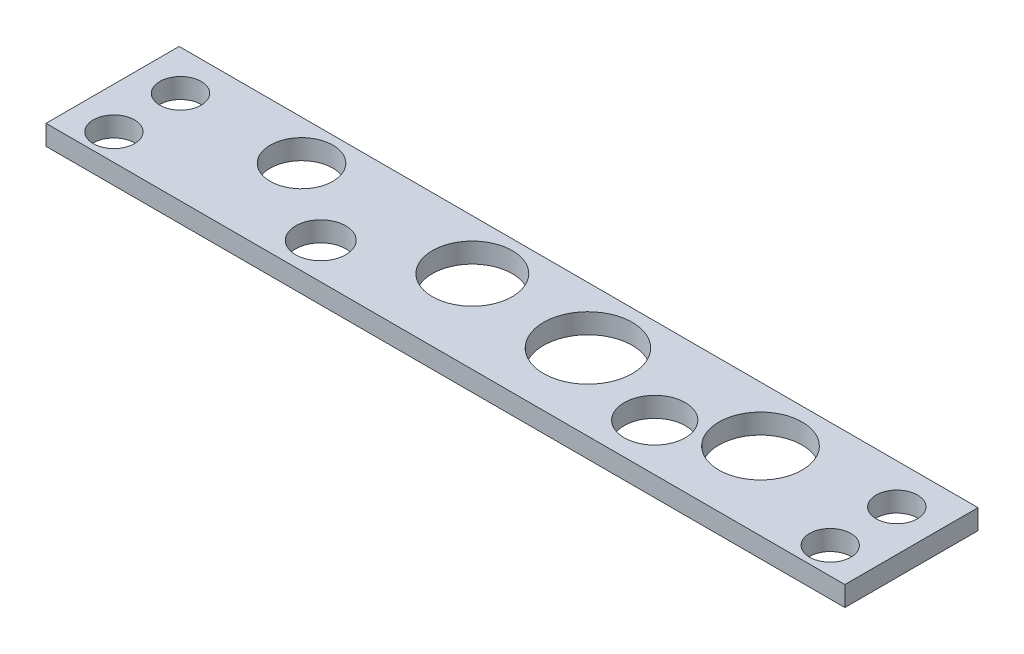
ISO-10303-21;
HEADER;
FILE_DESCRIPTION(('STEP AP214'),'2;1');
FILE_NAME('part.step','',(''),(''),'','','');
FILE_SCHEMA(('AUTOMOTIVE_DESIGN { 1 0 10303 214 1 1 1 1 }'));
ENDSEC;
DATA;
#1=APPLICATION_CONTEXT('core data for automotive mechanical design processes');
#2=APPLICATION_PROTOCOL_DEFINITION('international standard','automotive_design',2000,#1);
#3=PRODUCT_CONTEXT('',#1,'mechanical');
#4=PRODUCT('Part','Part','',(#3));
#5=PRODUCT_RELATED_PRODUCT_CATEGORY('part','',(#4));
#6=PRODUCT_DEFINITION_FORMATION('','',#4);
#7=PRODUCT_DEFINITION_CONTEXT('part definition',#1,'design');
#8=PRODUCT_DEFINITION('design','',#6,#7);
#9=PRODUCT_DEFINITION_SHAPE('','',#8);
#10=(LENGTH_UNIT() NAMED_UNIT(*) SI_UNIT(.MILLI.,.METRE.));
#11=(NAMED_UNIT(*) PLANE_ANGLE_UNIT() SI_UNIT($,.RADIAN.));
#12=(NAMED_UNIT(*) SI_UNIT($,.STERADIAN.) SOLID_ANGLE_UNIT());
#13=UNCERTAINTY_MEASURE_WITH_UNIT(LENGTH_MEASURE(1.E-05),#10,'distance_accuracy_value','');
#14=(GEOMETRIC_REPRESENTATION_CONTEXT(3) GLOBAL_UNCERTAINTY_ASSIGNED_CONTEXT((#13)) GLOBAL_UNIT_ASSIGNED_CONTEXT((#10,
#11,#12)) REPRESENTATION_CONTEXT('',''));
#15=CARTESIAN_POINT('',(0.,0.,0.));
#16=DIRECTION('',(0.,0.,1.));
#17=DIRECTION('',(1.,0.,0.));
#18=AXIS2_PLACEMENT_3D('',#15,#16,#17);
#19=CARTESIAN_POINT('',(-30.,1.5,0.));
#20=DIRECTION('',(1.,0.,0.));
#21=DIRECTION('',(0.,0.,-1.));
#22=AXIS2_PLACEMENT_3D('',#19,#20,#21);
#23=PLANE('',#22);
#24=DIRECTION('',(0.,0.,1.));
#25=VECTOR('',#24,1.);
#26=CARTESIAN_POINT('',(-30.,0.,0.));
#27=LINE('',#26,#25);
#28=CARTESIAN_POINT('',(-30.,0.,-9.99999999999999));
#29=VERTEX_POINT('',#28);
#30=CARTESIAN_POINT('',(-30.,0.,0.));
#31=VERTEX_POINT('',#30);
#32=EDGE_CURVE('E129',#29,#31,#27,.T.);
#33=ORIENTED_EDGE('',*,*,#32,.T.);
#34=DIRECTION('',(0.,-1.,0.));
#35=VECTOR('',#34,1.);
#36=CARTESIAN_POINT('',(-30.,1.5,0.));
#37=LINE('',#36,#35);
#38=CARTESIAN_POINT('',(-30.,1.5,0.));
#39=VERTEX_POINT('',#38);
#40=EDGE_CURVE('E11',#39,#31,#37,.T.);
#41=ORIENTED_EDGE('',*,*,#40,.F.);
#42=DIRECTION('',(0.,0.,1.));
#43=VECTOR('',#42,1.);
#44=CARTESIAN_POINT('',(-30.,1.5,0.));
#45=LINE('',#44,#43);
#46=CARTESIAN_POINT('',(-30.,1.5,-9.99999999999999));
#47=VERTEX_POINT('',#46);
#48=EDGE_CURVE('E87',#47,#39,#45,.T.);
#49=ORIENTED_EDGE('',*,*,#48,.F.);
#50=DIRECTION('',(0.,-1.,0.));
#51=VECTOR('',#50,1.);
#52=CARTESIAN_POINT('',(-30.,1.5,-9.99999999999999));
#53=LINE('',#52,#51);
#54=EDGE_CURVE('E95',#47,#29,#53,.T.);
#55=ORIENTED_EDGE('',*,*,#54,.T.);
#56=EDGE_LOOP('',(#33,#41,#49,#55));
#57=FACE_BOUND('',#56,.T.);
#58=ADVANCED_FACE('F35',(#57),#23,.F.);
#59=CARTESIAN_POINT('',(0.,1.5,0.));
#60=DIRECTION('',(0.,0.,-1.));
#61=DIRECTION('',(-1.,0.,0.));
#62=AXIS2_PLACEMENT_3D('',#59,#60,#61);
#63=PLANE('',#62);
#64=DIRECTION('',(1.,0.,0.));
#65=VECTOR('',#64,1.);
#66=CARTESIAN_POINT('',(0.,0.,0.));
#67=LINE('',#66,#65);
#68=CARTESIAN_POINT('',(30.,0.,0.));
#69=VERTEX_POINT('',#68);
#70=EDGE_CURVE('E91',#31,#69,#67,.T.);
#71=ORIENTED_EDGE('',*,*,#70,.T.);
#72=DIRECTION('',(0.,-1.,0.));
#73=VECTOR('',#72,1.);
#74=CARTESIAN_POINT('',(30.,1.5,0.));
#75=LINE('',#74,#73);
#76=CARTESIAN_POINT('',(30.,1.5,0.));
#77=VERTEX_POINT('',#76);
#78=EDGE_CURVE('E44',#77,#69,#75,.T.);
#79=ORIENTED_EDGE('',*,*,#78,.F.);
#80=DIRECTION('',(1.,0.,0.));
#81=VECTOR('',#80,1.);
#82=CARTESIAN_POINT('',(0.,1.5,0.));
#83=LINE('',#82,#81);
#84=EDGE_CURVE('E82',#39,#77,#83,.T.);
#85=ORIENTED_EDGE('',*,*,#84,.F.);
#86=ORIENTED_EDGE('',*,*,#40,.T.);
#87=EDGE_LOOP('',(#71,#79,#85,#86));
#88=FACE_BOUND('',#87,.T.);
#89=ADVANCED_FACE('F90',(#88),#63,.F.);
#90=CARTESIAN_POINT('',(30.,1.5,0.));
#91=DIRECTION('',(-1.,0.,0.));
#92=DIRECTION('',(0.,0.,1.));
#93=AXIS2_PLACEMENT_3D('',#90,#91,#92);
#94=PLANE('',#93);
#95=DIRECTION('',(0.,0.,-1.));
#96=VECTOR('',#95,1.);
#97=CARTESIAN_POINT('',(30.,0.,0.));
#98=LINE('',#97,#96);
#99=CARTESIAN_POINT('',(30.,0.,-10.));
#100=VERTEX_POINT('',#99);
#101=EDGE_CURVE('E69',#69,#100,#98,.T.);
#102=ORIENTED_EDGE('',*,*,#101,.T.);
#103=DIRECTION('',(0.,-1.,0.));
#104=VECTOR('',#103,1.);
#105=CARTESIAN_POINT('',(30.,1.5,-10.));
#106=LINE('',#105,#104);
#107=CARTESIAN_POINT('',(30.,1.5,-10.));
#108=VERTEX_POINT('',#107);
#109=EDGE_CURVE('E92',#108,#100,#106,.T.);
#110=ORIENTED_EDGE('',*,*,#109,.F.);
#111=DIRECTION('',(0.,0.,-1.));
#112=VECTOR('',#111,1.);
#113=CARTESIAN_POINT('',(30.,1.5,0.));
#114=LINE('',#113,#112);
#115=EDGE_CURVE('E85',#77,#108,#114,.T.);
#116=ORIENTED_EDGE('',*,*,#115,.F.);
#117=ORIENTED_EDGE('',*,*,#78,.T.);
#118=EDGE_LOOP('',(#102,#110,#116,#117));
#119=FACE_BOUND('',#118,.T.);
#120=ADVANCED_FACE('F93',(#119),#94,.F.);
#121=CARTESIAN_POINT('',(26.9,1.5,-2.));
#122=DIRECTION('',(0.,-1.,0.));
#123=DIRECTION('',(0.,0.,-1.));
#124=AXIS2_PLACEMENT_3D('',#121,#122,#123);
#125=CYLINDRICAL_SURFACE('',#124,1.55);
#126=CARTESIAN_POINT('',(26.9,1.5,-2.));
#127=DIRECTION('',(0.,1.,0.));
#128=DIRECTION('',(0.,0.,1.));
#129=AXIS2_PLACEMENT_3D('',#126,#127,#128);
#130=CIRCLE('',#129,1.55);
#131=CARTESIAN_POINT('',(26.9,1.5,-0.449999999999999));
#132=VERTEX_POINT('',#131);
#133=EDGE_CURVE('E142',#132,#132,#130,.T.);
#134=ORIENTED_EDGE('',*,*,#133,.T.);
#135=EDGE_LOOP('',(#134));
#136=FACE_BOUND('',#135,.T.);
#137=CARTESIAN_POINT('',(26.9,0.,-2.));
#138=DIRECTION('',(0.,1.,0.));
#139=DIRECTION('',(0.,0.,1.));
#140=AXIS2_PLACEMENT_3D('',#137,#138,#139);
#141=CIRCLE('',#140,1.55);
#142=CARTESIAN_POINT('',(26.9,0.,-0.449999999999999));
#143=VERTEX_POINT('',#142);
#144=EDGE_CURVE('E126',#143,#143,#141,.T.);
#145=ORIENTED_EDGE('',*,*,#144,.F.);
#146=EDGE_LOOP('',(#145));
#147=FACE_BOUND('',#146,.T.);
#148=ADVANCED_FACE('F196',(#136,#147),#125,.F.);
#149=CARTESIAN_POINT('',(26.9,1.5,-7.));
#150=DIRECTION('',(0.,-1.,0.));
#151=DIRECTION('',(0.,0.,-1.));
#152=AXIS2_PLACEMENT_3D('',#149,#150,#151);
#153=CYLINDRICAL_SURFACE('',#152,1.55);
#154=CARTESIAN_POINT('',(26.9,1.5,-7.));
#155=DIRECTION('',(0.,1.,0.));
#156=DIRECTION('',(0.,0.,1.));
#157=AXIS2_PLACEMENT_3D('',#154,#155,#156);
#158=CIRCLE('',#157,1.55);
#159=CARTESIAN_POINT('',(26.9,1.5,-5.45));
#160=VERTEX_POINT('',#159);
#161=EDGE_CURVE('E144',#160,#160,#158,.T.);
#162=ORIENTED_EDGE('',*,*,#161,.T.);
#163=EDGE_LOOP('',(#162));
#164=FACE_BOUND('',#163,.T.);
#165=CARTESIAN_POINT('',(26.9,0.,-7.));
#166=DIRECTION('',(0.,1.,0.));
#167=DIRECTION('',(0.,0.,1.));
#168=AXIS2_PLACEMENT_3D('',#165,#166,#167);
#169=CIRCLE('',#168,1.55);
#170=CARTESIAN_POINT('',(26.9,0.,-5.45));
#171=VERTEX_POINT('',#170);
#172=EDGE_CURVE('E123',#171,#171,#169,.T.);
#173=ORIENTED_EDGE('',*,*,#172,.F.);
#174=EDGE_LOOP('',(#173));
#175=FACE_BOUND('',#174,.T.);
#176=ADVANCED_FACE('F199',(#164,#175),#153,.F.);
#177=CARTESIAN_POINT('',(-26.9,1.5,-7.));
#178=DIRECTION('',(0.,-1.,0.));
#179=DIRECTION('',(0.,0.,-1.));
#180=AXIS2_PLACEMENT_3D('',#177,#178,#179);
#181=CYLINDRICAL_SURFACE('',#180,1.55);
#182=CARTESIAN_POINT('',(-26.9,1.5,-7.));
#183=DIRECTION('',(0.,1.,0.));
#184=DIRECTION('',(0.,0.,1.));
#185=AXIS2_PLACEMENT_3D('',#182,#183,#184);
#186=CIRCLE('',#185,1.55);
#187=CARTESIAN_POINT('',(-26.9,1.5,-5.45));
#188=VERTEX_POINT('',#187);
#189=EDGE_CURVE('E149',#188,#188,#186,.T.);
#190=ORIENTED_EDGE('',*,*,#189,.T.);
#191=EDGE_LOOP('',(#190));
#192=FACE_BOUND('',#191,.T.);
#193=CARTESIAN_POINT('',(-26.9,0.,-7.));
#194=DIRECTION('',(0.,1.,0.));
#195=DIRECTION('',(0.,0.,1.));
#196=AXIS2_PLACEMENT_3D('',#193,#194,#195);
#197=CIRCLE('',#196,1.55);
#198=CARTESIAN_POINT('',(-26.9,0.,-5.45));
#199=VERTEX_POINT('',#198);
#200=EDGE_CURVE('E120',#199,#199,#197,.T.);
#201=ORIENTED_EDGE('',*,*,#200,.F.);
#202=EDGE_LOOP('',(#201));
#203=FACE_BOUND('',#202,.T.);
#204=ADVANCED_FACE('F220',(#192,#203),#181,.F.);
#205=CARTESIAN_POINT('',(-26.9,1.5,-2.));
#206=DIRECTION('',(0.,-1.,0.));
#207=DIRECTION('',(0.,0.,-1.));
#208=AXIS2_PLACEMENT_3D('',#205,#206,#207);
#209=CYLINDRICAL_SURFACE('',#208,1.55);
#210=CARTESIAN_POINT('',(-26.9,1.5,-2.));
#211=DIRECTION('',(0.,1.,0.));
#212=DIRECTION('',(0.,0.,1.));
#213=AXIS2_PLACEMENT_3D('',#210,#211,#212);
#214=CIRCLE('',#213,1.55);
#215=CARTESIAN_POINT('',(-26.9,1.5,-0.449999999999999));
#216=VERTEX_POINT('',#215);
#217=EDGE_CURVE('E152',#216,#216,#214,.T.);
#218=ORIENTED_EDGE('',*,*,#217,.T.);
#219=EDGE_LOOP('',(#218));
#220=FACE_BOUND('',#219,.T.);
#221=CARTESIAN_POINT('',(-26.9,0.,-2.));
#222=DIRECTION('',(0.,1.,0.));
#223=DIRECTION('',(0.,0.,1.));
#224=AXIS2_PLACEMENT_3D('',#221,#222,#223);
#225=CIRCLE('',#224,1.55);
#226=CARTESIAN_POINT('',(-26.9,0.,-0.449999999999999));
#227=VERTEX_POINT('',#226);
#228=EDGE_CURVE('E117',#227,#227,#225,.T.);
#229=ORIENTED_EDGE('',*,*,#228,.F.);
#230=EDGE_LOOP('',(#229));
#231=FACE_BOUND('',#230,.T.);
#232=ADVANCED_FACE('F224',(#220,#231),#209,.F.);
#233=CARTESIAN_POINT('',(-17.8083593652843,1.5,-7.));
#234=DIRECTION('',(0.,-1.,0.));
#235=DIRECTION('',(0.,0.,-1.));
#236=AXIS2_PLACEMENT_3D('',#233,#234,#235);
#237=CYLINDRICAL_SURFACE('',#236,2.35393084260795);
#238=CARTESIAN_POINT('',(-17.8083593652843,1.5,-7.));
#239=DIRECTION('',(0.,1.,0.));
#240=DIRECTION('',(0.,0.,1.));
#241=AXIS2_PLACEMENT_3D('',#238,#239,#240);
#242=CIRCLE('',#241,2.35393084260795);
#243=CARTESIAN_POINT('',(-17.8083593652843,1.5,-4.64606915739205));
#244=VERTEX_POINT('',#243);
#245=EDGE_CURVE('E155',#244,#244,#242,.T.);
#246=ORIENTED_EDGE('',*,*,#245,.T.);
#247=EDGE_LOOP('',(#246));
#248=FACE_BOUND('',#247,.T.);
#249=CARTESIAN_POINT('',(-17.8083593652843,0.,-7.));
#250=DIRECTION('',(0.,1.,0.));
#251=DIRECTION('',(0.,0.,1.));
#252=AXIS2_PLACEMENT_3D('',#249,#250,#251);
#253=CIRCLE('',#252,2.35393084260795);
#254=CARTESIAN_POINT('',(-17.8083593652843,0.,-4.64606915739205));
#255=VERTEX_POINT('',#254);
#256=EDGE_CURVE('E114',#255,#255,#253,.T.);
#257=ORIENTED_EDGE('',*,*,#256,.F.);
#258=EDGE_LOOP('',(#257));
#259=FACE_BOUND('',#258,.T.);
#260=ADVANCED_FACE('F228',(#248,#259),#237,.F.);
#261=CARTESIAN_POINT('',(-12.0745172063337,1.5,-2.70767688611827));
#262=DIRECTION('',(0.,-1.,0.));
#263=DIRECTION('',(0.,0.,-1.));
#264=AXIS2_PLACEMENT_3D('',#261,#262,#263);
#265=CYLINDRICAL_SURFACE('',#264,1.88397670936946);
#266=CARTESIAN_POINT('',(-12.0745172063337,1.5,-2.70767688611827));
#267=DIRECTION('',(0.,1.,0.));
#268=DIRECTION('',(0.,0.,1.));
#269=AXIS2_PLACEMENT_3D('',#266,#267,#268);
#270=CIRCLE('',#269,1.88397670936946);
#271=CARTESIAN_POINT('',(-12.0745172063337,1.5,-0.823700176748806));
#272=VERTEX_POINT('',#271);
#273=EDGE_CURVE('E158',#272,#272,#270,.T.);
#274=ORIENTED_EDGE('',*,*,#273,.T.);
#275=EDGE_LOOP('',(#274));
#276=FACE_BOUND('',#275,.T.);
#277=CARTESIAN_POINT('',(-12.0745172063337,0.,-2.70767688611827));
#278=DIRECTION('',(0.,1.,0.));
#279=DIRECTION('',(0.,0.,1.));
#280=AXIS2_PLACEMENT_3D('',#277,#278,#279);
#281=CIRCLE('',#280,1.88397670936946);
#282=CARTESIAN_POINT('',(-12.0745172063337,0.,-0.823700176748806));
#283=VERTEX_POINT('',#282);
#284=EDGE_CURVE('E111',#283,#283,#281,.T.);
#285=ORIENTED_EDGE('',*,*,#284,.F.);
#286=EDGE_LOOP('',(#285));
#287=FACE_BOUND('',#286,.T.);
#288=ADVANCED_FACE('F232',(#276,#287),#265,.F.);
#289=CARTESIAN_POINT('',(-4.21096224548723,1.5,-6.22989421233076));
#290=DIRECTION('',(0.,-1.,0.));
#291=DIRECTION('',(0.,0.,-1.));
#292=AXIS2_PLACEMENT_3D('',#289,#290,#291);
#293=CYLINDRICAL_SURFACE('',#292,3.);
#294=CARTESIAN_POINT('',(-4.21096224548723,1.5,-6.22989421233076));
#295=DIRECTION('',(0.,1.,0.));
#296=DIRECTION('',(0.,0.,1.));
#297=AXIS2_PLACEMENT_3D('',#294,#295,#296);
#298=CIRCLE('',#297,3.);
#299=CARTESIAN_POINT('',(-4.21096224548723,1.5,-3.22989421233076));
#300=VERTEX_POINT('',#299);
#301=EDGE_CURVE('E161',#300,#300,#298,.T.);
#302=ORIENTED_EDGE('',*,*,#301,.T.);
#303=EDGE_LOOP('',(#302));
#304=FACE_BOUND('',#303,.T.);
#305=CARTESIAN_POINT('',(-4.21096224548723,0.,-6.22989421233076));
#306=DIRECTION('',(0.,1.,0.));
#307=DIRECTION('',(0.,0.,1.));
#308=AXIS2_PLACEMENT_3D('',#305,#306,#307);
#309=CIRCLE('',#308,3.);
#310=CARTESIAN_POINT('',(-4.21096224548723,0.,-3.22989421233076));
#311=VERTEX_POINT('',#310);
#312=EDGE_CURVE('E108',#311,#311,#309,.T.);
#313=ORIENTED_EDGE('',*,*,#312,.F.);
#314=EDGE_LOOP('',(#313));
#315=FACE_BOUND('',#314,.T.);
#316=ADVANCED_FACE('F236',(#304,#315),#293,.F.);
#317=CARTESIAN_POINT('',(4.96318520883367,1.5,-5.73842202727785));
#318=DIRECTION('',(0.,-1.,0.));
#319=DIRECTION('',(0.,0.,-1.));
#320=AXIS2_PLACEMENT_3D('',#317,#318,#319);
#321=CYLINDRICAL_SURFACE('',#320,3.33433282383565);
#322=CARTESIAN_POINT('',(4.96318520883367,1.5,-5.73842202727785));
#323=DIRECTION('',(0.,1.,0.));
#324=DIRECTION('',(0.,0.,1.));
#325=AXIS2_PLACEMENT_3D('',#322,#323,#324);
#326=CIRCLE('',#325,3.33433282383565);
#327=CARTESIAN_POINT('',(4.96318520883367,1.5,-2.40408920344219));
#328=VERTEX_POINT('',#327);
#329=EDGE_CURVE('E164',#328,#328,#326,.T.);
#330=ORIENTED_EDGE('',*,*,#329,.T.);
#331=EDGE_LOOP('',(#330));
#332=FACE_BOUND('',#331,.T.);
#333=CARTESIAN_POINT('',(4.96318520883367,0.,-5.73842202727785));
#334=DIRECTION('',(0.,1.,0.));
#335=DIRECTION('',(0.,0.,1.));
#336=AXIS2_PLACEMENT_3D('',#333,#334,#335);
#337=CIRCLE('',#336,3.33433282383565);
#338=CARTESIAN_POINT('',(4.96318520883367,0.,-2.40408920344219));
#339=VERTEX_POINT('',#338);
#340=EDGE_CURVE('E105',#339,#339,#337,.T.);
#341=ORIENTED_EDGE('',*,*,#340,.F.);
#342=EDGE_LOOP('',(#341));
#343=FACE_BOUND('',#342,.T.);
#344=ADVANCED_FACE('F240',(#332,#343),#321,.F.);
#345=CARTESIAN_POINT('',(12.1714439229429,1.5,-3.55));
#346=DIRECTION('',(0.,-1.,0.));
#347=DIRECTION('',(0.,0.,-1.));
#348=AXIS2_PLACEMENT_3D('',#345,#346,#347);
#349=CYLINDRICAL_SURFACE('',#348,2.29023685385132);
#350=CARTESIAN_POINT('',(12.1714439229429,1.5,-3.55));
#351=DIRECTION('',(0.,1.,0.));
#352=DIRECTION('',(0.,0.,1.));
#353=AXIS2_PLACEMENT_3D('',#350,#351,#352);
#354=CIRCLE('',#353,2.29023685385132);
#355=CARTESIAN_POINT('',(12.1714439229429,1.5,-1.25976314614868));
#356=VERTEX_POINT('',#355);
#357=EDGE_CURVE('E167',#356,#356,#354,.T.);
#358=ORIENTED_EDGE('',*,*,#357,.T.);
#359=EDGE_LOOP('',(#358));
#360=FACE_BOUND('',#359,.T.);
#361=CARTESIAN_POINT('',(12.1714439229429,0.,-3.55));
#362=DIRECTION('',(0.,1.,0.));
#363=DIRECTION('',(0.,0.,1.));
#364=AXIS2_PLACEMENT_3D('',#361,#362,#363);
#365=CIRCLE('',#364,2.29023685385132);
#366=CARTESIAN_POINT('',(12.1714439229429,0.,-1.25976314614868));
#367=VERTEX_POINT('',#366);
#368=EDGE_CURVE('E102',#367,#367,#365,.T.);
#369=ORIENTED_EDGE('',*,*,#368,.F.);
#370=EDGE_LOOP('',(#369));
#371=FACE_BOUND('',#370,.T.);
#372=ADVANCED_FACE('F243',(#360,#371),#349,.F.);
#373=CARTESIAN_POINT('',(17.8233740510513,1.5,-5.84023685385132));
#374=DIRECTION('',(0.,-1.,0.));
#375=DIRECTION('',(0.,0.,-1.));
#376=AXIS2_PLACEMENT_3D('',#373,#374,#375);
#377=CYLINDRICAL_SURFACE('',#376,3.12743688430289);
#378=CARTESIAN_POINT('',(17.8233740510513,1.5,-5.84023685385132));
#379=DIRECTION('',(0.,1.,0.));
#380=DIRECTION('',(0.,0.,1.));
#381=AXIS2_PLACEMENT_3D('',#378,#379,#380);
#382=CIRCLE('',#381,3.12743688430289);
#383=CARTESIAN_POINT('',(17.8233740510513,1.5,-2.71279996954842));
#384=VERTEX_POINT('',#383);
#385=EDGE_CURVE('E135',#384,#384,#382,.T.);
#386=ORIENTED_EDGE('',*,*,#385,.T.);
#387=EDGE_LOOP('',(#386));
#388=FACE_BOUND('',#387,.T.);
#389=CARTESIAN_POINT('',(17.8233740510513,0.,-5.84023685385132));
#390=DIRECTION('',(0.,1.,0.));
#391=DIRECTION('',(0.,0.,1.));
#392=AXIS2_PLACEMENT_3D('',#389,#390,#391);
#393=CIRCLE('',#392,3.12743688430289);
#394=CARTESIAN_POINT('',(17.8233740510513,0.,-2.71279996954842));
#395=VERTEX_POINT('',#394);
#396=EDGE_CURVE('E99',#395,#395,#393,.T.);
#397=ORIENTED_EDGE('',*,*,#396,.F.);
#398=EDGE_LOOP('',(#397));
#399=FACE_BOUND('',#398,.T.);
#400=ADVANCED_FACE('F37',(#388,#399),#377,.F.);
#401=CARTESIAN_POINT('',(0.,1.5,-10.));
#402=DIRECTION('',(0.,0.,1.));
#403=DIRECTION('',(1.,0.,0.));
#404=AXIS2_PLACEMENT_3D('',#401,#402,#403);
#405=PLANE('',#404);
#406=DIRECTION('',(-1.,0.,0.));
#407=VECTOR('',#406,1.);
#408=CARTESIAN_POINT('',(0.,0.,-10.));
#409=LINE('',#408,#407);
#410=EDGE_CURVE('E75',#100,#29,#409,.T.);
#411=ORIENTED_EDGE('',*,*,#410,.T.);
#412=ORIENTED_EDGE('',*,*,#54,.F.);
#413=DIRECTION('',(-1.,0.,0.));
#414=VECTOR('',#413,1.);
#415=CARTESIAN_POINT('',(0.,1.5,-10.));
#416=LINE('',#415,#414);
#417=EDGE_CURVE('E52',#108,#47,#416,.T.);
#418=ORIENTED_EDGE('',*,*,#417,.F.);
#419=ORIENTED_EDGE('',*,*,#109,.T.);
#420=EDGE_LOOP('',(#411,#412,#418,#419));
#421=FACE_BOUND('',#420,.T.);
#422=ADVANCED_FACE('F137',(#421),#405,.F.);
#423=CARTESIAN_POINT('',(0.,1.5,0.));
#424=DIRECTION('',(0.,1.,0.));
#425=DIRECTION('',(0.,0.,1.));
#426=AXIS2_PLACEMENT_3D('',#423,#424,#425);
#427=PLANE('',#426);
#428=ORIENTED_EDGE('',*,*,#385,.F.);
#429=EDGE_LOOP('',(#428));
#430=FACE_BOUND('',#429,.T.);
#431=ORIENTED_EDGE('',*,*,#357,.F.);
#432=EDGE_LOOP('',(#431));
#433=FACE_BOUND('',#432,.T.);
#434=ORIENTED_EDGE('',*,*,#329,.F.);
#435=EDGE_LOOP('',(#434));
#436=FACE_BOUND('',#435,.T.);
#437=ORIENTED_EDGE('',*,*,#301,.F.);
#438=EDGE_LOOP('',(#437));
#439=FACE_BOUND('',#438,.T.);
#440=ORIENTED_EDGE('',*,*,#273,.F.);
#441=EDGE_LOOP('',(#440));
#442=FACE_BOUND('',#441,.T.);
#443=ORIENTED_EDGE('',*,*,#245,.F.);
#444=EDGE_LOOP('',(#443));
#445=FACE_BOUND('',#444,.T.);
#446=ORIENTED_EDGE('',*,*,#217,.F.);
#447=EDGE_LOOP('',(#446));
#448=FACE_BOUND('',#447,.T.);
#449=ORIENTED_EDGE('',*,*,#189,.F.);
#450=EDGE_LOOP('',(#449));
#451=FACE_BOUND('',#450,.T.);
#452=ORIENTED_EDGE('',*,*,#161,.F.);
#453=EDGE_LOOP('',(#452));
#454=FACE_BOUND('',#453,.T.);
#455=ORIENTED_EDGE('',*,*,#133,.F.);
#456=EDGE_LOOP('',(#455));
#457=FACE_BOUND('',#456,.T.);
#458=ORIENTED_EDGE('',*,*,#48,.T.);
#459=ORIENTED_EDGE('',*,*,#84,.T.);
#460=ORIENTED_EDGE('',*,*,#115,.T.);
#461=ORIENTED_EDGE('',*,*,#417,.T.);
#462=EDGE_LOOP('',(#458,#459,#460,#461));
#463=FACE_BOUND('',#462,.T.);
#464=ADVANCED_FACE('F83',(#430,#433,#436,#439,#442,#445,#448,#451,#454,#457,#463),#427,.T.);
#465=CARTESIAN_POINT('',(0.,0.,0.));
#466=DIRECTION('',(0.,1.,0.));
#467=DIRECTION('',(0.,0.,1.));
#468=AXIS2_PLACEMENT_3D('',#465,#466,#467);
#469=PLANE('',#468);
#470=ORIENTED_EDGE('',*,*,#396,.T.);
#471=EDGE_LOOP('',(#470));
#472=FACE_BOUND('',#471,.T.);
#473=ORIENTED_EDGE('',*,*,#368,.T.);
#474=EDGE_LOOP('',(#473));
#475=FACE_BOUND('',#474,.T.);
#476=ORIENTED_EDGE('',*,*,#340,.T.);
#477=EDGE_LOOP('',(#476));
#478=FACE_BOUND('',#477,.T.);
#479=ORIENTED_EDGE('',*,*,#312,.T.);
#480=EDGE_LOOP('',(#479));
#481=FACE_BOUND('',#480,.T.);
#482=ORIENTED_EDGE('',*,*,#284,.T.);
#483=EDGE_LOOP('',(#482));
#484=FACE_BOUND('',#483,.T.);
#485=ORIENTED_EDGE('',*,*,#256,.T.);
#486=EDGE_LOOP('',(#485));
#487=FACE_BOUND('',#486,.T.);
#488=ORIENTED_EDGE('',*,*,#228,.T.);
#489=EDGE_LOOP('',(#488));
#490=FACE_BOUND('',#489,.T.);
#491=ORIENTED_EDGE('',*,*,#200,.T.);
#492=EDGE_LOOP('',(#491));
#493=FACE_BOUND('',#492,.T.);
#494=ORIENTED_EDGE('',*,*,#172,.T.);
#495=EDGE_LOOP('',(#494));
#496=FACE_BOUND('',#495,.T.);
#497=ORIENTED_EDGE('',*,*,#144,.T.);
#498=EDGE_LOOP('',(#497));
#499=FACE_BOUND('',#498,.T.);
#500=ORIENTED_EDGE('',*,*,#32,.F.);
#501=ORIENTED_EDGE('',*,*,#410,.F.);
#502=ORIENTED_EDGE('',*,*,#101,.F.);
#503=ORIENTED_EDGE('',*,*,#70,.F.);
#504=EDGE_LOOP('',(#500,#501,#502,#503));
#505=FACE_BOUND('',#504,.T.);
#506=ADVANCED_FACE('F140',(#472,#475,#478,#481,#484,#487,#490,#493,#496,#499,#505),#469,.F.);
#507=CLOSED_SHELL('',(#58,#89,#120,#148,#176,#204,#232,#260,#288,#316,#344,#372,#400,#422,#464,#506));
#508=MANIFOLD_SOLID_BREP('B2',#507);
#509=ADVANCED_BREP_SHAPE_REPRESENTATION('',(#18,#508),#14);
#510=SHAPE_DEFINITION_REPRESENTATION(#9,#509);
ENDSEC;
END-ISO-10303-21;
